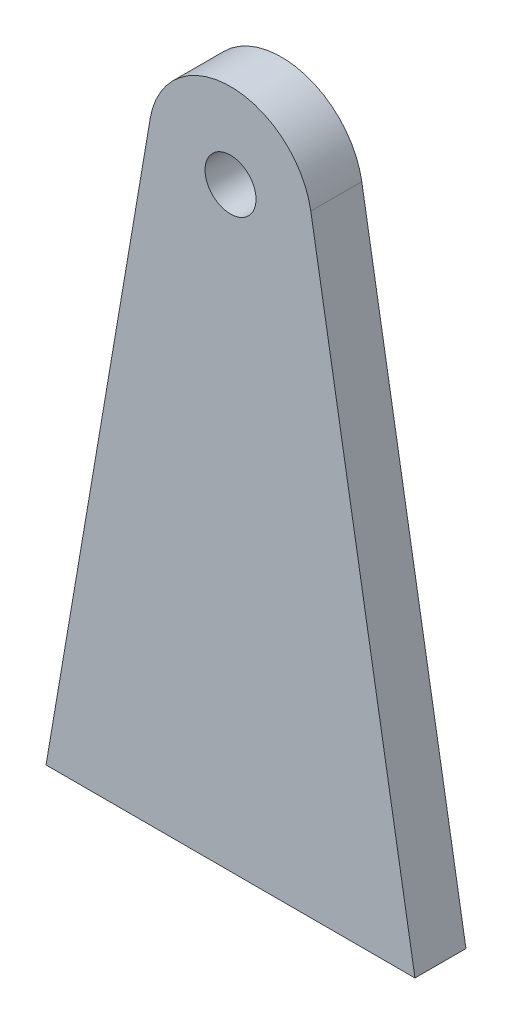
ISO-10303-21;
HEADER;
FILE_DESCRIPTION(('STEP AP214'),'2;1');
FILE_NAME('part.step','',(''),(''),'','','');
FILE_SCHEMA(('AUTOMOTIVE_DESIGN { 1 0 10303 214 1 1 1 1 }'));
ENDSEC;
DATA;
#1=APPLICATION_CONTEXT('core data for automotive mechanical design processes');
#2=APPLICATION_PROTOCOL_DEFINITION('international standard','automotive_design',2000,#1);
#3=PRODUCT_CONTEXT('',#1,'mechanical');
#4=PRODUCT('Part','Part','',(#3));
#5=PRODUCT_RELATED_PRODUCT_CATEGORY('part','',(#4));
#6=PRODUCT_DEFINITION_FORMATION('','',#4);
#7=PRODUCT_DEFINITION_CONTEXT('part definition',#1,'design');
#8=PRODUCT_DEFINITION('design','',#6,#7);
#9=PRODUCT_DEFINITION_SHAPE('','',#8);
#10=(LENGTH_UNIT() NAMED_UNIT(*) SI_UNIT(.MILLI.,.METRE.));
#11=(NAMED_UNIT(*) PLANE_ANGLE_UNIT() SI_UNIT($,.RADIAN.));
#12=(NAMED_UNIT(*) SI_UNIT($,.STERADIAN.) SOLID_ANGLE_UNIT());
#13=UNCERTAINTY_MEASURE_WITH_UNIT(LENGTH_MEASURE(1.E-05),#10,'distance_accuracy_value','');
#14=(GEOMETRIC_REPRESENTATION_CONTEXT(3) GLOBAL_UNCERTAINTY_ASSIGNED_CONTEXT((#13)) GLOBAL_UNIT_ASSIGNED_CONTEXT((#10,
#11,#12)) REPRESENTATION_CONTEXT('',''));
#15=CARTESIAN_POINT('',(0.,0.,0.));
#16=DIRECTION('',(0.,0.,1.));
#17=DIRECTION('',(1.,0.,0.));
#18=AXIS2_PLACEMENT_3D('',#15,#16,#17);
#19=CARTESIAN_POINT('',(0.,10.3024896690877,3.));
#20=DIRECTION('',(0.,0.,-1.));
#21=DIRECTION('',(-1.,0.,0.));
#22=AXIS2_PLACEMENT_3D('',#19,#20,#21);
#23=PLANE('',#22);
#24=DIRECTION('',(-0.167799348048361,-0.985821169784127,0.));
#25=VECTOR('',#24,1.);
#26=CARTESIAN_POINT('',(-10.8535639513607,-24.9057582701911,3.));
#27=LINE('',#26,#25);
#28=CARTESIAN_POINT('',(-4.72381062181568,11.1065425408862,3.));
#29=VERTEX_POINT('',#28);
#30=CARTESIAN_POINT('',(-10.8535639513607,-24.9057582701911,3.));
#31=VERTEX_POINT('',#30);
#32=EDGE_CURVE('E86',#29,#31,#27,.T.);
#33=ORIENTED_EDGE('',*,*,#32,.T.);
#34=DIRECTION('',(1.,0.,0.));
#35=VECTOR('',#34,1.);
#36=CARTESIAN_POINT('',(10.8535639513607,-24.9057582701911,3.));
#37=LINE('',#36,#35);
#38=CARTESIAN_POINT('',(10.8535639513607,-24.9057582701911,3.));
#39=VERTEX_POINT('',#38);
#40=EDGE_CURVE('E80',#31,#39,#37,.T.);
#41=ORIENTED_EDGE('',*,*,#40,.T.);
#42=DIRECTION('',(-0.167799348048361,0.985821169784127,0.));
#43=VECTOR('',#42,1.);
#44=CARTESIAN_POINT('',(10.8535639513607,-24.9057582701911,3.));
#45=LINE('',#44,#43);
#46=CARTESIAN_POINT('',(4.72381062181567,11.1065425408862,3.));
#47=VERTEX_POINT('',#46);
#48=EDGE_CURVE('E83',#39,#47,#45,.T.);
#49=ORIENTED_EDGE('',*,*,#48,.T.);
#50=CARTESIAN_POINT('',(0.,10.3024896690877,3.));
#51=DIRECTION('',(0.,0.,1.));
#52=DIRECTION('',(1.,0.,0.));
#53=AXIS2_PLACEMENT_3D('',#50,#51,#52);
#54=CIRCLE('',#53,4.7917520607212);
#55=EDGE_CURVE('E52',#47,#29,#54,.T.);
#56=ORIENTED_EDGE('',*,*,#55,.T.);
#57=EDGE_LOOP('',(#33,#41,#49,#56));
#58=FACE_BOUND('',#57,.T.);
#59=CARTESIAN_POINT('',(0.,10.0942417298089,3.));
#60=DIRECTION('',(0.,0.,1.));
#61=DIRECTION('',(1.,0.,0.));
#62=AXIS2_PLACEMENT_3D('',#59,#60,#61);
#63=CIRCLE('',#62,1.5);
#64=CARTESIAN_POINT('',(1.5,10.0942417298089,3.));
#65=VERTEX_POINT('',#64);
#66=EDGE_CURVE('E103',#65,#65,#63,.T.);
#67=ORIENTED_EDGE('',*,*,#66,.F.);
#68=EDGE_LOOP('',(#67));
#69=FACE_BOUND('',#68,.T.);
#70=ADVANCED_FACE('F35',(#58,#69),#23,.F.);
#71=CARTESIAN_POINT('',(0.,10.3024896690877,0.));
#72=DIRECTION('',(0.,0.,-1.));
#73=DIRECTION('',(-1.,0.,0.));
#74=AXIS2_PLACEMENT_3D('',#71,#72,#73);
#75=PLANE('',#74);
#76=DIRECTION('',(-0.167799348048361,-0.985821169784127,0.));
#77=VECTOR('',#76,1.);
#78=CARTESIAN_POINT('',(-10.8535639513607,-24.9057582701911,0.));
#79=LINE('',#78,#77);
#80=CARTESIAN_POINT('',(-4.72381062181568,11.1065425408862,0.));
#81=VERTEX_POINT('',#80);
#82=CARTESIAN_POINT('',(-10.8535639513607,-24.9057582701911,0.));
#83=VERTEX_POINT('',#82);
#84=EDGE_CURVE('E100',#81,#83,#79,.T.);
#85=ORIENTED_EDGE('',*,*,#84,.F.);
#86=CARTESIAN_POINT('',(0.,10.3024896690877,0.));
#87=DIRECTION('',(0.,0.,1.));
#88=DIRECTION('',(-1.,0.,0.));
#89=AXIS2_PLACEMENT_3D('',#86,#87,#88);
#90=CIRCLE('',#89,4.7917520607212);
#91=CARTESIAN_POINT('',(4.72381062181567,11.1065425408862,0.));
#92=VERTEX_POINT('',#91);
#93=EDGE_CURVE('E69',#92,#81,#90,.T.);
#94=ORIENTED_EDGE('',*,*,#93,.F.);
#95=DIRECTION('',(-0.167799348048361,0.985821169784127,0.));
#96=VECTOR('',#95,1.);
#97=CARTESIAN_POINT('',(10.8535639513607,-24.9057582701911,0.));
#98=LINE('',#97,#96);
#99=CARTESIAN_POINT('',(10.8535639513607,-24.9057582701911,0.));
#100=VERTEX_POINT('',#99);
#101=EDGE_CURVE('E105',#100,#92,#98,.T.);
#102=ORIENTED_EDGE('',*,*,#101,.F.);
#103=DIRECTION('',(1.,0.,0.));
#104=VECTOR('',#103,1.);
#105=CARTESIAN_POINT('',(10.8535639513607,-24.9057582701911,0.));
#106=LINE('',#105,#104);
#107=EDGE_CURVE('E91',#83,#100,#106,.T.);
#108=ORIENTED_EDGE('',*,*,#107,.F.);
#109=EDGE_LOOP('',(#85,#94,#102,#108));
#110=FACE_BOUND('',#109,.T.);
#111=CARTESIAN_POINT('',(0.,10.0942417298089,0.));
#112=DIRECTION('',(0.,0.,1.));
#113=DIRECTION('',(1.,0.,0.));
#114=AXIS2_PLACEMENT_3D('',#111,#112,#113);
#115=CIRCLE('',#114,1.5);
#116=CARTESIAN_POINT('',(1.5,10.0942417298089,0.));
#117=VERTEX_POINT('',#116);
#118=EDGE_CURVE('E112',#117,#117,#115,.T.);
#119=ORIENTED_EDGE('',*,*,#118,.T.);
#120=EDGE_LOOP('',(#119));
#121=FACE_BOUND('',#120,.T.);
#122=ADVANCED_FACE('F121',(#110,#121),#75,.T.);
#123=CARTESIAN_POINT('',(-10.8535639513607,-24.9057582701911,3.));
#124=DIRECTION('',(0.985821169784127,-0.167799348048361,0.));
#125=DIRECTION('',(0.167799348048361,0.985821169784127,0.));
#126=AXIS2_PLACEMENT_3D('',#123,#124,#125);
#127=PLANE('',#126);
#128=ORIENTED_EDGE('',*,*,#84,.T.);
#129=DIRECTION('',(0.,0.,-1.));
#130=VECTOR('',#129,1.);
#131=CARTESIAN_POINT('',(-10.8535639513607,-24.9057582701911,3.));
#132=LINE('',#131,#130);
#133=EDGE_CURVE('E11',#31,#83,#132,.T.);
#134=ORIENTED_EDGE('',*,*,#133,.F.);
#135=ORIENTED_EDGE('',*,*,#32,.F.);
#136=DIRECTION('',(0.,0.,-1.));
#137=VECTOR('',#136,1.);
#138=CARTESIAN_POINT('',(-4.72381062181568,11.1065425408862,3.));
#139=LINE('',#138,#137);
#140=EDGE_CURVE('E96',#29,#81,#139,.T.);
#141=ORIENTED_EDGE('',*,*,#140,.T.);
#142=EDGE_LOOP('',(#128,#134,#135,#141));
#143=FACE_BOUND('',#142,.T.);
#144=ADVANCED_FACE('F37',(#143),#127,.F.);
#145=CARTESIAN_POINT('',(10.8535639513607,-24.9057582701911,3.));
#146=DIRECTION('',(0.,1.,0.));
#147=DIRECTION('',(0.,0.,1.));
#148=AXIS2_PLACEMENT_3D('',#145,#146,#147);
#149=PLANE('',#148);
#150=ORIENTED_EDGE('',*,*,#107,.T.);
#151=DIRECTION('',(0.,0.,-1.));
#152=VECTOR('',#151,1.);
#153=CARTESIAN_POINT('',(10.8535639513607,-24.9057582701911,3.));
#154=LINE('',#153,#152);
#155=EDGE_CURVE('E44',#39,#100,#154,.T.);
#156=ORIENTED_EDGE('',*,*,#155,.F.);
#157=ORIENTED_EDGE('',*,*,#40,.F.);
#158=ORIENTED_EDGE('',*,*,#133,.T.);
#159=EDGE_LOOP('',(#150,#156,#157,#158));
#160=FACE_BOUND('',#159,.T.);
#161=ADVANCED_FACE('F90',(#160),#149,.F.);
#162=CARTESIAN_POINT('',(10.8535639513607,-24.9057582701911,3.));
#163=DIRECTION('',(-0.985821169784127,-0.167799348048361,0.));
#164=DIRECTION('',(0.167799348048361,-0.985821169784127,0.));
#165=AXIS2_PLACEMENT_3D('',#162,#163,#164);
#166=PLANE('',#165);
#167=ORIENTED_EDGE('',*,*,#101,.T.);
#168=DIRECTION('',(0.,0.,-1.));
#169=VECTOR('',#168,1.);
#170=CARTESIAN_POINT('',(4.72381062181567,11.1065425408862,3.));
#171=LINE('',#170,#169);
#172=EDGE_CURVE('E93',#47,#92,#171,.T.);
#173=ORIENTED_EDGE('',*,*,#172,.F.);
#174=ORIENTED_EDGE('',*,*,#48,.F.);
#175=ORIENTED_EDGE('',*,*,#155,.T.);
#176=EDGE_LOOP('',(#167,#173,#174,#175));
#177=FACE_BOUND('',#176,.T.);
#178=ADVANCED_FACE('F94',(#177),#166,.F.);
#179=CARTESIAN_POINT('',(0.,10.3024896690877,3.));
#180=DIRECTION('',(0.,0.,-1.));
#181=DIRECTION('',(-1.,0.,0.));
#182=AXIS2_PLACEMENT_3D('',#179,#180,#181);
#183=CYLINDRICAL_SURFACE('',#182,4.7917520607212);
#184=ORIENTED_EDGE('',*,*,#93,.T.);
#185=ORIENTED_EDGE('',*,*,#140,.F.);
#186=ORIENTED_EDGE('',*,*,#55,.F.);
#187=ORIENTED_EDGE('',*,*,#172,.T.);
#188=EDGE_LOOP('',(#184,#185,#186,#187));
#189=FACE_BOUND('',#188,.T.);
#190=ADVANCED_FACE('F109',(#189),#183,.T.);
#191=CARTESIAN_POINT('',(0.,10.0942417298089,3.));
#192=DIRECTION('',(0.,0.,-1.));
#193=DIRECTION('',(-1.,0.,0.));
#194=AXIS2_PLACEMENT_3D('',#191,#192,#193);
#195=CYLINDRICAL_SURFACE('',#194,1.5);
#196=ORIENTED_EDGE('',*,*,#66,.T.);
#197=EDGE_LOOP('',(#196));
#198=FACE_BOUND('',#197,.T.);
#199=ORIENTED_EDGE('',*,*,#118,.F.);
#200=EDGE_LOOP('',(#199));
#201=FACE_BOUND('',#200,.T.);
#202=ADVANCED_FACE('F118',(#198,#201),#195,.F.);
#203=CLOSED_SHELL('',(#70,#122,#144,#161,#178,#190,#202));
#204=MANIFOLD_SOLID_BREP('B2',#203);
#205=ADVANCED_BREP_SHAPE_REPRESENTATION('',(#18,#204),#14);
#206=SHAPE_DEFINITION_REPRESENTATION(#9,#205);
ENDSEC;
END-ISO-10303-21;
